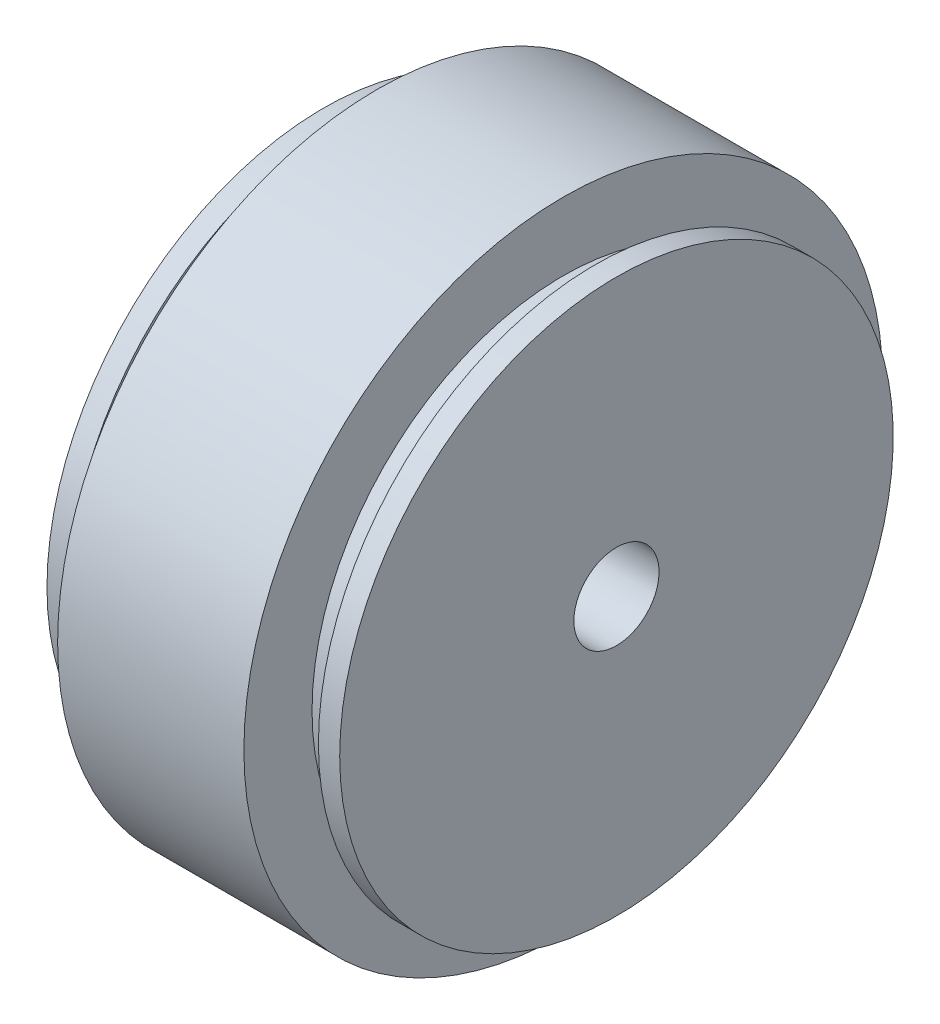
ISO-10303-21;
HEADER;
FILE_DESCRIPTION(('STEP AP214'),'2;1');
FILE_NAME('part.step','',(''),(''),'','','');
FILE_SCHEMA(('AUTOMOTIVE_DESIGN { 1 0 10303 214 1 1 1 1 }'));
ENDSEC;
DATA;
#1=APPLICATION_CONTEXT('core data for automotive mechanical design processes');
#2=APPLICATION_PROTOCOL_DEFINITION('international standard','automotive_design',2000,#1);
#3=PRODUCT_CONTEXT('',#1,'mechanical');
#4=PRODUCT('Part','Part','',(#3));
#5=PRODUCT_RELATED_PRODUCT_CATEGORY('part','',(#4));
#6=PRODUCT_DEFINITION_FORMATION('','',#4);
#7=PRODUCT_DEFINITION_CONTEXT('part definition',#1,'design');
#8=PRODUCT_DEFINITION('design','',#6,#7);
#9=PRODUCT_DEFINITION_SHAPE('','',#8);
#10=(LENGTH_UNIT() NAMED_UNIT(*) SI_UNIT(.MILLI.,.METRE.));
#11=(NAMED_UNIT(*) PLANE_ANGLE_UNIT() SI_UNIT($,.RADIAN.));
#12=(NAMED_UNIT(*) SI_UNIT($,.STERADIAN.) SOLID_ANGLE_UNIT());
#13=UNCERTAINTY_MEASURE_WITH_UNIT(LENGTH_MEASURE(1.E-05),#10,'distance_accuracy_value','');
#14=(GEOMETRIC_REPRESENTATION_CONTEXT(3) GLOBAL_UNCERTAINTY_ASSIGNED_CONTEXT((#13)) GLOBAL_UNIT_ASSIGNED_CONTEXT((#10,
#11,#12)) REPRESENTATION_CONTEXT('',''));
#15=CARTESIAN_POINT('',(0.,0.,0.));
#16=DIRECTION('',(0.,0.,1.));
#17=DIRECTION('',(1.,0.,0.));
#18=AXIS2_PLACEMENT_3D('',#15,#16,#17);
#19=CARTESIAN_POINT('',(20.,23.6,0.));
#20=DIRECTION('',(-1.,0.,0.));
#21=DIRECTION('',(0.,0.,1.));
#22=AXIS2_PLACEMENT_3D('',#19,#20,#21);
#23=PLANE('',#22);
#24=CARTESIAN_POINT('',(20.,0.,0.));
#25=DIRECTION('',(-1.,0.,0.));
#26=DIRECTION('',(0.,0.,1.));
#27=AXIS2_PLACEMENT_3D('',#24,#25,#26);
#28=CIRCLE('',#27,30.);
#29=CARTESIAN_POINT('',(20.,0.,30.));
#30=VERTEX_POINT('',#29);
#31=EDGE_CURVE('E75',#30,#30,#28,.T.);
#32=ORIENTED_EDGE('',*,*,#31,.F.);
#33=EDGE_LOOP('',(#32));
#34=FACE_BOUND('',#33,.T.);
#35=CARTESIAN_POINT('',(20.,0.,0.));
#36=DIRECTION('',(-1.,0.,0.));
#37=DIRECTION('',(0.,0.,1.));
#38=AXIS2_PLACEMENT_3D('',#35,#36,#37);
#39=CIRCLE('',#38,23.6);
#40=CARTESIAN_POINT('',(20.,0.,23.6));
#41=VERTEX_POINT('',#40);
#42=EDGE_CURVE('E10',#41,#41,#39,.T.);
#43=ORIENTED_EDGE('',*,*,#42,.T.);
#44=EDGE_LOOP('',(#43));
#45=FACE_BOUND('',#44,.T.);
#46=ADVANCED_FACE('F29',(#34,#45),#23,.F.);
#47=CARTESIAN_POINT('',(10.,0.,0.));
#48=DIRECTION('',(-1.,0.,0.));
#49=DIRECTION('',(0.,0.,1.));
#50=AXIS2_PLACEMENT_3D('',#47,#48,#49);
#51=CYLINDRICAL_SURFACE('',#50,23.6);
#52=ORIENTED_EDGE('',*,*,#42,.F.);
#53=EDGE_LOOP('',(#52));
#54=FACE_BOUND('',#53,.T.);
#55=CARTESIAN_POINT('',(23.,0.,0.));
#56=DIRECTION('',(-1.,0.,0.));
#57=DIRECTION('',(0.,0.,1.));
#58=AXIS2_PLACEMENT_3D('',#55,#56,#57);
#59=CIRCLE('',#58,23.6);
#60=CARTESIAN_POINT('',(23.,0.,23.6));
#61=VERTEX_POINT('',#60);
#62=EDGE_CURVE('E35',#61,#61,#59,.T.);
#63=ORIENTED_EDGE('',*,*,#62,.T.);
#64=EDGE_LOOP('',(#63));
#65=FACE_BOUND('',#64,.T.);
#66=ADVANCED_FACE('F82',(#54,#65),#51,.T.);
#67=CARTESIAN_POINT('',(23.,23.6,0.));
#68=DIRECTION('',(1.,0.,0.));
#69=DIRECTION('',(0.,0.,-1.));
#70=AXIS2_PLACEMENT_3D('',#67,#68,#69);
#71=PLANE('',#70);
#72=ORIENTED_EDGE('',*,*,#62,.F.);
#73=EDGE_LOOP('',(#72));
#74=FACE_BOUND('',#73,.T.);
#75=CARTESIAN_POINT('',(23.,0.,0.));
#76=DIRECTION('',(-1.,0.,0.));
#77=DIRECTION('',(0.,0.,1.));
#78=AXIS2_PLACEMENT_3D('',#75,#76,#77);
#79=CIRCLE('',#78,26.);
#80=CARTESIAN_POINT('',(23.,0.,26.));
#81=VERTEX_POINT('',#80);
#82=EDGE_CURVE('E39',#81,#81,#79,.T.);
#83=ORIENTED_EDGE('',*,*,#82,.T.);
#84=EDGE_LOOP('',(#83));
#85=FACE_BOUND('',#84,.T.);
#86=ADVANCED_FACE('F86',(#74,#85),#71,.F.);
#87=CARTESIAN_POINT('',(10.,0.,0.));
#88=DIRECTION('',(-1.,0.,0.));
#89=DIRECTION('',(0.,0.,1.));
#90=AXIS2_PLACEMENT_3D('',#87,#88,#89);
#91=CYLINDRICAL_SURFACE('',#90,26.);
#92=ORIENTED_EDGE('',*,*,#82,.F.);
#93=EDGE_LOOP('',(#92));
#94=FACE_BOUND('',#93,.T.);
#95=CARTESIAN_POINT('',(25.,0.,0.));
#96=DIRECTION('',(-1.,0.,0.));
#97=DIRECTION('',(0.,0.,1.));
#98=AXIS2_PLACEMENT_3D('',#95,#96,#97);
#99=CIRCLE('',#98,26.);
#100=CARTESIAN_POINT('',(25.,0.,26.));
#101=VERTEX_POINT('',#100);
#102=EDGE_CURVE('E43',#101,#101,#99,.T.);
#103=ORIENTED_EDGE('',*,*,#102,.T.);
#104=EDGE_LOOP('',(#103));
#105=FACE_BOUND('',#104,.T.);
#106=ADVANCED_FACE('F91',(#94,#105),#91,.T.);
#107=CARTESIAN_POINT('',(25.,4.,0.));
#108=DIRECTION('',(-1.,0.,0.));
#109=DIRECTION('',(0.,0.,1.));
#110=AXIS2_PLACEMENT_3D('',#107,#108,#109);
#111=PLANE('',#110);
#112=ORIENTED_EDGE('',*,*,#102,.F.);
#113=EDGE_LOOP('',(#112));
#114=FACE_BOUND('',#113,.T.);
#115=CARTESIAN_POINT('',(25.,0.,0.));
#116=DIRECTION('',(-1.,0.,0.));
#117=DIRECTION('',(0.,0.,1.));
#118=AXIS2_PLACEMENT_3D('',#115,#116,#117);
#119=CIRCLE('',#118,4.);
#120=CARTESIAN_POINT('',(25.,0.,4.));
#121=VERTEX_POINT('',#120);
#122=EDGE_CURVE('E48',#121,#121,#119,.T.);
#123=ORIENTED_EDGE('',*,*,#122,.T.);
#124=EDGE_LOOP('',(#123));
#125=FACE_BOUND('',#124,.T.);
#126=ADVANCED_FACE('F97',(#114,#125),#111,.F.);
#127=CARTESIAN_POINT('',(10.,0.,0.));
#128=DIRECTION('',(-1.,0.,0.));
#129=DIRECTION('',(0.,0.,1.));
#130=AXIS2_PLACEMENT_3D('',#127,#128,#129);
#131=CYLINDRICAL_SURFACE('',#130,4.);
#132=ORIENTED_EDGE('',*,*,#122,.F.);
#133=EDGE_LOOP('',(#132));
#134=FACE_BOUND('',#133,.T.);
#135=CARTESIAN_POINT('',(10.,0.,0.));
#136=DIRECTION('',(-1.,0.,0.));
#137=DIRECTION('',(0.,0.,1.));
#138=AXIS2_PLACEMENT_3D('',#135,#136,#137);
#139=CIRCLE('',#138,4.);
#140=CARTESIAN_POINT('',(10.,0.,4.));
#141=VERTEX_POINT('',#140);
#142=EDGE_CURVE('E51',#141,#141,#139,.T.);
#143=ORIENTED_EDGE('',*,*,#142,.T.);
#144=EDGE_LOOP('',(#143));
#145=FACE_BOUND('',#144,.T.);
#146=ADVANCED_FACE('F101',(#134,#145),#131,.F.);
#147=CARTESIAN_POINT('',(10.,4.,0.));
#148=DIRECTION('',(1.,0.,0.));
#149=DIRECTION('',(0.,0.,-1.));
#150=AXIS2_PLACEMENT_3D('',#147,#148,#149);
#151=PLANE('',#150);
#152=ORIENTED_EDGE('',*,*,#142,.F.);
#153=EDGE_LOOP('',(#152));
#154=FACE_BOUND('',#153,.T.);
#155=CARTESIAN_POINT('',(10.,0.,0.));
#156=DIRECTION('',(-1.,0.,0.));
#157=DIRECTION('',(0.,0.,1.));
#158=AXIS2_PLACEMENT_3D('',#155,#156,#157);
#159=CIRCLE('',#158,19.6);
#160=CARTESIAN_POINT('',(10.,0.,19.6));
#161=VERTEX_POINT('',#160);
#162=EDGE_CURVE('E54',#161,#161,#159,.T.);
#163=ORIENTED_EDGE('',*,*,#162,.T.);
#164=EDGE_LOOP('',(#163));
#165=FACE_BOUND('',#164,.T.);
#166=ADVANCED_FACE('F105',(#154,#165),#151,.F.);
#167=CARTESIAN_POINT('',(10.,0.,0.));
#168=DIRECTION('',(-1.,0.,0.));
#169=DIRECTION('',(0.,0.,1.));
#170=AXIS2_PLACEMENT_3D('',#167,#168,#169);
#171=CYLINDRICAL_SURFACE('',#170,19.6);
#172=ORIENTED_EDGE('',*,*,#162,.F.);
#173=EDGE_LOOP('',(#172));
#174=FACE_BOUND('',#173,.T.);
#175=CARTESIAN_POINT('',(-2.5,0.,0.));
#176=DIRECTION('',(-1.,0.,0.));
#177=DIRECTION('',(0.,0.,1.));
#178=AXIS2_PLACEMENT_3D('',#175,#176,#177);
#179=CIRCLE('',#178,19.6);
#180=CARTESIAN_POINT('',(-2.5,0.,19.6));
#181=VERTEX_POINT('',#180);
#182=EDGE_CURVE('E57',#181,#181,#179,.T.);
#183=ORIENTED_EDGE('',*,*,#182,.T.);
#184=EDGE_LOOP('',(#183));
#185=FACE_BOUND('',#184,.T.);
#186=ADVANCED_FACE('F109',(#174,#185),#171,.F.);
#187=CARTESIAN_POINT('',(-2.5,19.6,0.));
#188=DIRECTION('',(1.,0.,0.));
#189=DIRECTION('',(0.,0.,-1.));
#190=AXIS2_PLACEMENT_3D('',#187,#188,#189);
#191=PLANE('',#190);
#192=ORIENTED_EDGE('',*,*,#182,.F.);
#193=EDGE_LOOP('',(#192));
#194=FACE_BOUND('',#193,.T.);
#195=CARTESIAN_POINT('',(-2.5,0.,0.));
#196=DIRECTION('',(-1.,0.,0.));
#197=DIRECTION('',(0.,0.,1.));
#198=AXIS2_PLACEMENT_3D('',#195,#196,#197);
#199=CIRCLE('',#198,26.);
#200=CARTESIAN_POINT('',(-2.5,0.,26.));
#201=VERTEX_POINT('',#200);
#202=EDGE_CURVE('E60',#201,#201,#199,.T.);
#203=ORIENTED_EDGE('',*,*,#202,.T.);
#204=EDGE_LOOP('',(#203));
#205=FACE_BOUND('',#204,.T.);
#206=ADVANCED_FACE('F113',(#194,#205),#191,.F.);
#207=CARTESIAN_POINT('',(10.,0.,0.));
#208=DIRECTION('',(-1.,0.,0.));
#209=DIRECTION('',(0.,0.,1.));
#210=AXIS2_PLACEMENT_3D('',#207,#208,#209);
#211=CYLINDRICAL_SURFACE('',#210,26.);
#212=ORIENTED_EDGE('',*,*,#202,.F.);
#213=EDGE_LOOP('',(#212));
#214=FACE_BOUND('',#213,.T.);
#215=CARTESIAN_POINT('',(-0.5,0.,0.));
#216=DIRECTION('',(-1.,0.,0.));
#217=DIRECTION('',(0.,0.,1.));
#218=AXIS2_PLACEMENT_3D('',#215,#216,#217);
#219=CIRCLE('',#218,26.);
#220=CARTESIAN_POINT('',(-0.5,0.,26.));
#221=VERTEX_POINT('',#220);
#222=EDGE_CURVE('E63',#221,#221,#219,.T.);
#223=ORIENTED_EDGE('',*,*,#222,.T.);
#224=EDGE_LOOP('',(#223));
#225=FACE_BOUND('',#224,.T.);
#226=ADVANCED_FACE('F117',(#214,#225),#211,.T.);
#227=CARTESIAN_POINT('',(-0.500000000000001,23.6,0.));
#228=DIRECTION('',(-1.,0.,0.));
#229=DIRECTION('',(0.,0.,1.));
#230=AXIS2_PLACEMENT_3D('',#227,#228,#229);
#231=PLANE('',#230);
#232=ORIENTED_EDGE('',*,*,#222,.F.);
#233=EDGE_LOOP('',(#232));
#234=FACE_BOUND('',#233,.T.);
#235=CARTESIAN_POINT('',(-0.5,0.,0.));
#236=DIRECTION('',(-1.,0.,0.));
#237=DIRECTION('',(0.,0.,1.));
#238=AXIS2_PLACEMENT_3D('',#235,#236,#237);
#239=CIRCLE('',#238,23.6);
#240=CARTESIAN_POINT('',(-0.5,0.,23.6));
#241=VERTEX_POINT('',#240);
#242=EDGE_CURVE('E66',#241,#241,#239,.T.);
#243=ORIENTED_EDGE('',*,*,#242,.T.);
#244=EDGE_LOOP('',(#243));
#245=FACE_BOUND('',#244,.T.);
#246=ADVANCED_FACE('F121',(#234,#245),#231,.F.);
#247=CARTESIAN_POINT('',(10.,0.,0.));
#248=DIRECTION('',(-1.,0.,0.));
#249=DIRECTION('',(0.,0.,1.));
#250=AXIS2_PLACEMENT_3D('',#247,#248,#249);
#251=CYLINDRICAL_SURFACE('',#250,23.6);
#252=ORIENTED_EDGE('',*,*,#242,.F.);
#253=EDGE_LOOP('',(#252));
#254=FACE_BOUND('',#253,.T.);
#255=CARTESIAN_POINT('',(2.5,0.,0.));
#256=DIRECTION('',(-1.,0.,0.));
#257=DIRECTION('',(0.,0.,1.));
#258=AXIS2_PLACEMENT_3D('',#255,#256,#257);
#259=CIRCLE('',#258,23.6);
#260=CARTESIAN_POINT('',(2.5,0.,23.6));
#261=VERTEX_POINT('',#260);
#262=EDGE_CURVE('E69',#261,#261,#259,.T.);
#263=ORIENTED_EDGE('',*,*,#262,.T.);
#264=EDGE_LOOP('',(#263));
#265=FACE_BOUND('',#264,.T.);
#266=ADVANCED_FACE('F125',(#254,#265),#251,.T.);
#267=CARTESIAN_POINT('',(2.5,23.6,0.));
#268=DIRECTION('',(1.,0.,0.));
#269=DIRECTION('',(0.,0.,-1.));
#270=AXIS2_PLACEMENT_3D('',#267,#268,#269);
#271=PLANE('',#270);
#272=ORIENTED_EDGE('',*,*,#262,.F.);
#273=EDGE_LOOP('',(#272));
#274=FACE_BOUND('',#273,.T.);
#275=CARTESIAN_POINT('',(2.5,0.,0.));
#276=DIRECTION('',(-1.,0.,0.));
#277=DIRECTION('',(0.,0.,1.));
#278=AXIS2_PLACEMENT_3D('',#275,#276,#277);
#279=CIRCLE('',#278,30.);
#280=CARTESIAN_POINT('',(2.5,0.,30.));
#281=VERTEX_POINT('',#280);
#282=EDGE_CURVE('E72',#281,#281,#279,.T.);
#283=ORIENTED_EDGE('',*,*,#282,.T.);
#284=EDGE_LOOP('',(#283));
#285=FACE_BOUND('',#284,.T.);
#286=ADVANCED_FACE('F129',(#274,#285),#271,.F.);
#287=CARTESIAN_POINT('',(10.,0.,0.));
#288=DIRECTION('',(-1.,0.,0.));
#289=DIRECTION('',(0.,0.,1.));
#290=AXIS2_PLACEMENT_3D('',#287,#288,#289);
#291=CYLINDRICAL_SURFACE('',#290,30.);
#292=ORIENTED_EDGE('',*,*,#282,.F.);
#293=EDGE_LOOP('',(#292));
#294=FACE_BOUND('',#293,.T.);
#295=ORIENTED_EDGE('',*,*,#31,.T.);
#296=EDGE_LOOP('',(#295));
#297=FACE_BOUND('',#296,.T.);
#298=ADVANCED_FACE('F79',(#294,#297),#291,.T.);
#299=CLOSED_SHELL('',(#46,#66,#86,#106,#126,#146,#166,#186,#206,#226,#246,#266,#286,#298));
#300=MANIFOLD_SOLID_BREP('B2',#299);
#301=ADVANCED_BREP_SHAPE_REPRESENTATION('',(#18,#300),#14);
#302=SHAPE_DEFINITION_REPRESENTATION(#9,#301);
ENDSEC;
END-ISO-10303-21;
